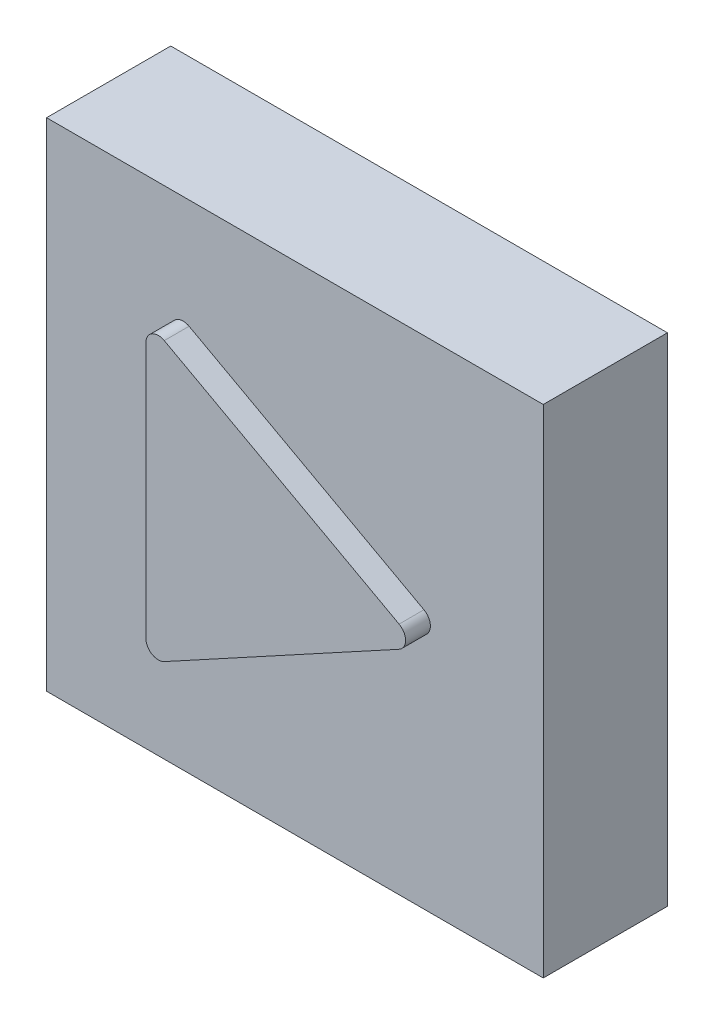
ISO-10303-21;
HEADER;
FILE_DESCRIPTION(('STEP AP214'),'2;1');
FILE_NAME('part.step','',(''),(''),'','','');
FILE_SCHEMA(('AUTOMOTIVE_DESIGN { 1 0 10303 214 1 1 1 1 }'));
ENDSEC;
DATA;
#1=APPLICATION_CONTEXT('core data for automotive mechanical design processes');
#2=APPLICATION_PROTOCOL_DEFINITION('international standard','automotive_design',2000,#1);
#3=PRODUCT_CONTEXT('',#1,'mechanical');
#4=PRODUCT('Part','Part','',(#3));
#5=PRODUCT_RELATED_PRODUCT_CATEGORY('part','',(#4));
#6=PRODUCT_DEFINITION_FORMATION('','',#4);
#7=PRODUCT_DEFINITION_CONTEXT('part definition',#1,'design');
#8=PRODUCT_DEFINITION('design','',#6,#7);
#9=PRODUCT_DEFINITION_SHAPE('','',#8);
#10=(LENGTH_UNIT() NAMED_UNIT(*) SI_UNIT(.MILLI.,.METRE.));
#11=(NAMED_UNIT(*) PLANE_ANGLE_UNIT() SI_UNIT($,.RADIAN.));
#12=(NAMED_UNIT(*) SI_UNIT($,.STERADIAN.) SOLID_ANGLE_UNIT());
#13=UNCERTAINTY_MEASURE_WITH_UNIT(LENGTH_MEASURE(1.E-05),#10,'distance_accuracy_value','');
#14=(GEOMETRIC_REPRESENTATION_CONTEXT(3) GLOBAL_UNCERTAINTY_ASSIGNED_CONTEXT((#13)) GLOBAL_UNIT_ASSIGNED_CONTEXT((#10,
#11,#12)) REPRESENTATION_CONTEXT('',''));
#15=CARTESIAN_POINT('',(0.,0.,0.));
#16=DIRECTION('',(0.,0.,1.));
#17=DIRECTION('',(1.,0.,0.));
#18=AXIS2_PLACEMENT_3D('',#15,#16,#17);
#19=CARTESIAN_POINT('',(0.,0.,5.));
#20=DIRECTION('',(0.,0.,-1.));
#21=DIRECTION('',(-1.,0.,0.));
#22=AXIS2_PLACEMENT_3D('',#19,#20,#21);
#23=PLANE('',#22);
#24=DIRECTION('',(0.,1.,0.));
#25=VECTOR('',#24,1.);
#26=CARTESIAN_POINT('',(10.,-10.,5.));
#27=LINE('',#26,#25);
#28=CARTESIAN_POINT('',(10.,-10.,5.));
#29=VERTEX_POINT('',#28);
#30=CARTESIAN_POINT('',(10.,10.,5.));
#31=VERTEX_POINT('',#30);
#32=EDGE_CURVE('E143',#29,#31,#27,.T.);
#33=ORIENTED_EDGE('',*,*,#32,.T.);
#34=DIRECTION('',(-1.,0.,0.));
#35=VECTOR('',#34,1.);
#36=CARTESIAN_POINT('',(-10.,10.,5.));
#37=LINE('',#36,#35);
#38=CARTESIAN_POINT('',(-10.,10.,5.));
#39=VERTEX_POINT('',#38);
#40=EDGE_CURVE('E146',#31,#39,#37,.T.);
#41=ORIENTED_EDGE('',*,*,#40,.T.);
#42=DIRECTION('',(0.,-1.,0.));
#43=VECTOR('',#42,1.);
#44=CARTESIAN_POINT('',(-10.,-10.,5.));
#45=LINE('',#44,#43);
#46=CARTESIAN_POINT('',(-10.,-10.,5.));
#47=VERTEX_POINT('',#46);
#48=EDGE_CURVE('E149',#39,#47,#45,.T.);
#49=ORIENTED_EDGE('',*,*,#48,.T.);
#50=DIRECTION('',(1.,0.,0.));
#51=VECTOR('',#50,1.);
#52=CARTESIAN_POINT('',(-10.,-10.,5.));
#53=LINE('',#52,#51);
#54=EDGE_CURVE('E151',#47,#29,#53,.T.);
#55=ORIENTED_EDGE('',*,*,#54,.T.);
#56=EDGE_LOOP('',(#33,#41,#49,#55));
#57=FACE_BOUND('',#56,.T.);
#58=CARTESIAN_POINT('',(-4.5,-5.15772890517538,5.));
#59=DIRECTION('',(0.,0.,1.));
#60=DIRECTION('',(1.,0.,0.));
#61=AXIS2_PLACEMENT_3D('',#58,#59,#60);
#62=CIRCLE('',#61,0.5);
#63=CARTESIAN_POINT('',(-5.,-5.15772890517537,5.));
#64=VERTEX_POINT('',#63);
#65=CARTESIAN_POINT('',(-4.26057393465971,-5.59667669163257,5.));
#66=VERTEX_POINT('',#65);
#67=EDGE_CURVE('E130',#64,#66,#62,.T.);
#68=ORIENTED_EDGE('',*,*,#67,.F.);
#69=DIRECTION('',(0.,-1.,0.));
#70=VECTOR('',#69,1.);
#71=CARTESIAN_POINT('',(-5.,5.15772890517537,5.));
#72=LINE('',#71,#70);
#73=CARTESIAN_POINT('',(-5.,5.15772890517537,5.));
#74=VERTEX_POINT('',#73);
#75=EDGE_CURVE('E127',#74,#64,#72,.T.);
#76=ORIENTED_EDGE('',*,*,#75,.F.);
#77=CARTESIAN_POINT('',(-4.5,5.15772890517538,5.));
#78=DIRECTION('',(0.,0.,1.));
#79=DIRECTION('',(-1.,0.,0.));
#80=AXIS2_PLACEMENT_3D('',#77,#78,#79);
#81=CIRCLE('',#80,0.5);
#82=CARTESIAN_POINT('',(-4.26057393465971,5.59667669163257,5.));
#83=VERTEX_POINT('',#82);
#84=EDGE_CURVE('E305',#83,#74,#81,.T.);
#85=ORIENTED_EDGE('',*,*,#84,.F.);
#86=DIRECTION('',(-0.877895572914384,0.478852130680573,0.));
#87=VECTOR('',#86,1.);
#88=CARTESIAN_POINT('',(5.19526239149514,0.438947786457196,5.));
#89=LINE('',#88,#87);
#90=CARTESIAN_POINT('',(5.19526239149514,0.438947786457197,5.));
#91=VERTEX_POINT('',#90);
#92=EDGE_CURVE('E320',#91,#83,#89,.T.);
#93=ORIENTED_EDGE('',*,*,#92,.F.);
#94=CARTESIAN_POINT('',(4.95583632615486,0.,5.));
#95=DIRECTION('',(0.,0.,1.));
#96=DIRECTION('',(1.,0.,0.));
#97=AXIS2_PLACEMENT_3D('',#94,#95,#96);
#98=CIRCLE('',#97,0.5);
#99=CARTESIAN_POINT('',(5.19526239149514,-0.438947786457196,5.));
#100=VERTEX_POINT('',#99);
#101=EDGE_CURVE('E53',#100,#91,#98,.T.);
#102=ORIENTED_EDGE('',*,*,#101,.F.);
#103=DIRECTION('',(0.877895572914384,0.478852130680573,0.));
#104=VECTOR('',#103,1.);
#105=CARTESIAN_POINT('',(-4.26057393465971,-5.59667669163257,5.));
#106=LINE('',#105,#104);
#107=EDGE_CURVE('E48',#66,#100,#106,.T.);
#108=ORIENTED_EDGE('',*,*,#107,.F.);
#109=EDGE_LOOP('',(#68,#76,#85,#93,#102,#108));
#110=FACE_BOUND('',#109,.T.);
#111=ADVANCED_FACE('F33',(#57,#110),#23,.F.);
#112=CARTESIAN_POINT('',(10.,-10.,5.));
#113=DIRECTION('',(-1.,0.,0.));
#114=DIRECTION('',(0.,0.,1.));
#115=AXIS2_PLACEMENT_3D('',#112,#113,#114);
#116=PLANE('',#115);
#117=DIRECTION('',(0.,1.,0.));
#118=VECTOR('',#117,1.);
#119=CARTESIAN_POINT('',(10.,-10.,0.));
#120=LINE('',#119,#118);
#121=CARTESIAN_POINT('',(10.,-10.,0.));
#122=VERTEX_POINT('',#121);
#123=CARTESIAN_POINT('',(10.,10.,0.));
#124=VERTEX_POINT('',#123);
#125=EDGE_CURVE('E142',#122,#124,#120,.T.);
#126=ORIENTED_EDGE('',*,*,#125,.T.);
#127=DIRECTION('',(0.,0.,-1.));
#128=VECTOR('',#127,1.);
#129=CARTESIAN_POINT('',(10.,10.,5.));
#130=LINE('',#129,#128);
#131=EDGE_CURVE('E11',#31,#124,#130,.T.);
#132=ORIENTED_EDGE('',*,*,#131,.F.);
#133=ORIENTED_EDGE('',*,*,#32,.F.);
#134=DIRECTION('',(0.,0.,-1.));
#135=VECTOR('',#134,1.);
#136=CARTESIAN_POINT('',(10.,-10.,5.));
#137=LINE('',#136,#135);
#138=EDGE_CURVE('E153',#29,#122,#137,.T.);
#139=ORIENTED_EDGE('',*,*,#138,.T.);
#140=EDGE_LOOP('',(#126,#132,#133,#139));
#141=FACE_BOUND('',#140,.T.);
#142=ADVANCED_FACE('F35',(#141),#116,.F.);
#143=CARTESIAN_POINT('',(-10.,10.,5.));
#144=DIRECTION('',(0.,-1.,0.));
#145=DIRECTION('',(0.,0.,-1.));
#146=AXIS2_PLACEMENT_3D('',#143,#144,#145);
#147=PLANE('',#146);
#148=DIRECTION('',(-1.,0.,0.));
#149=VECTOR('',#148,1.);
#150=CARTESIAN_POINT('',(-10.,10.,0.));
#151=LINE('',#150,#149);
#152=CARTESIAN_POINT('',(-10.,10.,0.));
#153=VERTEX_POINT('',#152);
#154=EDGE_CURVE('E156',#124,#153,#151,.T.);
#155=ORIENTED_EDGE('',*,*,#154,.T.);
#156=DIRECTION('',(0.,0.,-1.));
#157=VECTOR('',#156,1.);
#158=CARTESIAN_POINT('',(-10.,10.,5.));
#159=LINE('',#158,#157);
#160=EDGE_CURVE('E41',#39,#153,#159,.T.);
#161=ORIENTED_EDGE('',*,*,#160,.F.);
#162=ORIENTED_EDGE('',*,*,#40,.F.);
#163=ORIENTED_EDGE('',*,*,#131,.T.);
#164=EDGE_LOOP('',(#155,#161,#162,#163));
#165=FACE_BOUND('',#164,.T.);
#166=ADVANCED_FACE('F185',(#165),#147,.F.);
#167=CARTESIAN_POINT('',(-10.,-10.,5.));
#168=DIRECTION('',(1.,0.,0.));
#169=DIRECTION('',(0.,0.,-1.));
#170=AXIS2_PLACEMENT_3D('',#167,#168,#169);
#171=PLANE('',#170);
#172=DIRECTION('',(0.,-1.,0.));
#173=VECTOR('',#172,1.);
#174=CARTESIAN_POINT('',(-10.,-10.,0.));
#175=LINE('',#174,#173);
#176=CARTESIAN_POINT('',(-10.,-10.,0.));
#177=VERTEX_POINT('',#176);
#178=EDGE_CURVE('E158',#153,#177,#175,.T.);
#179=ORIENTED_EDGE('',*,*,#178,.T.);
#180=DIRECTION('',(0.,0.,-1.));
#181=VECTOR('',#180,1.);
#182=CARTESIAN_POINT('',(-10.,-10.,5.));
#183=LINE('',#182,#181);
#184=EDGE_CURVE('E163',#47,#177,#183,.T.);
#185=ORIENTED_EDGE('',*,*,#184,.F.);
#186=ORIENTED_EDGE('',*,*,#48,.F.);
#187=ORIENTED_EDGE('',*,*,#160,.T.);
#188=EDGE_LOOP('',(#179,#185,#186,#187));
#189=FACE_BOUND('',#188,.T.);
#190=ADVANCED_FACE('F170',(#189),#171,.F.);
#191=CARTESIAN_POINT('',(-10.,-10.,5.));
#192=DIRECTION('',(0.,1.,0.));
#193=DIRECTION('',(0.,0.,1.));
#194=AXIS2_PLACEMENT_3D('',#191,#192,#193);
#195=PLANE('',#194);
#196=DIRECTION('',(1.,0.,0.));
#197=VECTOR('',#196,1.);
#198=CARTESIAN_POINT('',(-10.,-10.,0.));
#199=LINE('',#198,#197);
#200=EDGE_CURVE('E147',#177,#122,#199,.T.);
#201=ORIENTED_EDGE('',*,*,#200,.T.);
#202=ORIENTED_EDGE('',*,*,#138,.F.);
#203=ORIENTED_EDGE('',*,*,#54,.F.);
#204=ORIENTED_EDGE('',*,*,#184,.T.);
#205=EDGE_LOOP('',(#201,#202,#203,#204));
#206=FACE_BOUND('',#205,.T.);
#207=ADVANCED_FACE('F179',(#206),#195,.F.);
#208=CARTESIAN_POINT('',(0.,0.,0.));
#209=DIRECTION('',(0.,0.,-1.));
#210=DIRECTION('',(-1.,0.,0.));
#211=AXIS2_PLACEMENT_3D('',#208,#209,#210);
#212=PLANE('',#211);
#213=CARTESIAN_POINT('',(0.,0.,0.));
#214=DIRECTION('',(0.,0.,1.));
#215=DIRECTION('',(1.,0.,0.));
#216=AXIS2_PLACEMENT_3D('',#213,#214,#215);
#217=CIRCLE('',#216,0.6);
#218=CARTESIAN_POINT('',(0.6,0.,0.));
#219=VERTEX_POINT('',#218);
#220=EDGE_CURVE('E134',#219,#219,#217,.T.);
#221=ORIENTED_EDGE('',*,*,#220,.T.);
#222=EDGE_LOOP('',(#221));
#223=FACE_BOUND('',#222,.T.);
#224=ORIENTED_EDGE('',*,*,#125,.F.);
#225=ORIENTED_EDGE('',*,*,#200,.F.);
#226=ORIENTED_EDGE('',*,*,#178,.F.);
#227=ORIENTED_EDGE('',*,*,#154,.F.);
#228=EDGE_LOOP('',(#224,#225,#226,#227));
#229=FACE_BOUND('',#228,.T.);
#230=ADVANCED_FACE('F176',(#223,#229),#212,.T.);
#231=CARTESIAN_POINT('',(0.,0.,0.));
#232=DIRECTION('',(0.,0.,1.));
#233=DIRECTION('',(1.,0.,0.));
#234=AXIS2_PLACEMENT_3D('',#231,#232,#233);
#235=CYLINDRICAL_SURFACE('',#234,0.6);
#236=ORIENTED_EDGE('',*,*,#220,.F.);
#237=EDGE_LOOP('',(#236));
#238=FACE_BOUND('',#237,.T.);
#239=CARTESIAN_POINT('',(0.,0.,5.));
#240=DIRECTION('',(0.,0.,1.));
#241=DIRECTION('',(1.,0.,0.));
#242=AXIS2_PLACEMENT_3D('',#239,#240,#241);
#243=CIRCLE('',#242,0.6);
#244=CARTESIAN_POINT('',(0.6,0.,5.));
#245=VERTEX_POINT('',#244);
#246=EDGE_CURVE('E131',#245,#245,#243,.F.);
#247=ORIENTED_EDGE('',*,*,#246,.F.);
#248=EDGE_LOOP('',(#247));
#249=FACE_BOUND('',#248,.T.);
#250=ADVANCED_FACE('F200',(#238,#249),#235,.F.);
#251=CARTESIAN_POINT('',(-4.5,-5.15772890517538,5.));
#252=DIRECTION('',(0.,0.,1.));
#253=DIRECTION('',(1.,0.,0.));
#254=AXIS2_PLACEMENT_3D('',#251,#252,#253);
#255=PLANE('',#254);
#256=ORIENTED_EDGE('',*,*,#246,.T.);
#257=EDGE_LOOP('',(#256));
#258=FACE_BOUND('',#257,.T.);
#259=ADVANCED_FACE('F227',(#258),#255,.F.);
#260=CARTESIAN_POINT('',(-4.5,-5.15772890517538,6.));
#261=DIRECTION('',(0.,0.,-1.));
#262=DIRECTION('',(-1.,0.,0.));
#263=AXIS2_PLACEMENT_3D('',#260,#261,#262);
#264=CYLINDRICAL_SURFACE('',#263,0.5);
#265=ORIENTED_EDGE('',*,*,#67,.T.);
#266=DIRECTION('',(0.,0.,-1.));
#267=VECTOR('',#266,1.);
#268=CARTESIAN_POINT('',(-4.26057393465971,-5.59667669163257,6.));
#269=LINE('',#268,#267);
#270=CARTESIAN_POINT('',(-4.26057393465971,-5.59667669163257,6.));
#271=VERTEX_POINT('',#270);
#272=EDGE_CURVE('E111',#271,#66,#269,.T.);
#273=ORIENTED_EDGE('',*,*,#272,.F.);
#274=CARTESIAN_POINT('',(-4.5,-5.15772890517538,6.));
#275=DIRECTION('',(0.,0.,1.));
#276=DIRECTION('',(1.,0.,0.));
#277=AXIS2_PLACEMENT_3D('',#274,#275,#276);
#278=CIRCLE('',#277,0.5);
#279=CARTESIAN_POINT('',(-5.,-5.15772890517537,6.));
#280=VERTEX_POINT('',#279);
#281=EDGE_CURVE('E118',#280,#271,#278,.T.);
#282=ORIENTED_EDGE('',*,*,#281,.F.);
#283=DIRECTION('',(0.,0.,-1.));
#284=VECTOR('',#283,1.);
#285=CARTESIAN_POINT('',(-5.,-5.15772890517537,6.));
#286=LINE('',#285,#284);
#287=EDGE_CURVE('E301',#280,#64,#286,.T.);
#288=ORIENTED_EDGE('',*,*,#287,.T.);
#289=EDGE_LOOP('',(#265,#273,#282,#288));
#290=FACE_BOUND('',#289,.T.);
#291=ADVANCED_FACE('F129',(#290),#264,.T.);
#292=CARTESIAN_POINT('',(-4.26057393465971,-5.59667669163257,6.));
#293=DIRECTION('',(-0.478852130680573,0.877895572914384,0.));
#294=DIRECTION('',(-0.877895572914384,-0.478852130680573,0.));
#295=AXIS2_PLACEMENT_3D('',#292,#293,#294);
#296=PLANE('',#295);
#297=ORIENTED_EDGE('',*,*,#107,.T.);
#298=DIRECTION('',(0.,0.,-1.));
#299=VECTOR('',#298,1.);
#300=CARTESIAN_POINT('',(5.19526239149514,-0.438947786457196,6.));
#301=LINE('',#300,#299);
#302=CARTESIAN_POINT('',(5.19526239149514,-0.438947786457196,6.));
#303=VERTEX_POINT('',#302);
#304=EDGE_CURVE('E114',#303,#100,#301,.T.);
#305=ORIENTED_EDGE('',*,*,#304,.F.);
#306=DIRECTION('',(0.877895572914384,0.478852130680573,0.));
#307=VECTOR('',#306,1.);
#308=CARTESIAN_POINT('',(-4.26057393465971,-5.59667669163257,6.));
#309=LINE('',#308,#307);
#310=EDGE_CURVE('E107',#271,#303,#309,.T.);
#311=ORIENTED_EDGE('',*,*,#310,.F.);
#312=ORIENTED_EDGE('',*,*,#272,.T.);
#313=EDGE_LOOP('',(#297,#305,#311,#312));
#314=FACE_BOUND('',#313,.T.);
#315=ADVANCED_FACE('F109',(#314),#296,.F.);
#316=CARTESIAN_POINT('',(4.95583632615486,0.,6.));
#317=DIRECTION('',(0.,0.,-1.));
#318=DIRECTION('',(-1.,0.,0.));
#319=AXIS2_PLACEMENT_3D('',#316,#317,#318);
#320=CYLINDRICAL_SURFACE('',#319,0.5);
#321=ORIENTED_EDGE('',*,*,#101,.T.);
#322=DIRECTION('',(0.,0.,-1.));
#323=VECTOR('',#322,1.);
#324=CARTESIAN_POINT('',(5.19526239149514,0.438947786457196,6.));
#325=LINE('',#324,#323);
#326=CARTESIAN_POINT('',(5.19526239149514,0.438947786457196,6.));
#327=VERTEX_POINT('',#326);
#328=EDGE_CURVE('E136',#327,#91,#325,.T.);
#329=ORIENTED_EDGE('',*,*,#328,.F.);
#330=CARTESIAN_POINT('',(4.95583632615486,0.,6.));
#331=DIRECTION('',(0.,0.,1.));
#332=DIRECTION('',(1.,0.,0.));
#333=AXIS2_PLACEMENT_3D('',#330,#331,#332);
#334=CIRCLE('',#333,0.5);
#335=EDGE_CURVE('E117',#303,#327,#334,.T.);
#336=ORIENTED_EDGE('',*,*,#335,.F.);
#337=ORIENTED_EDGE('',*,*,#304,.T.);
#338=EDGE_LOOP('',(#321,#329,#336,#337));
#339=FACE_BOUND('',#338,.T.);
#340=ADVANCED_FACE('F243',(#339),#320,.T.);
#341=CARTESIAN_POINT('',(5.19526239149514,0.438947786457196,6.));
#342=DIRECTION('',(-0.478852130680573,-0.877895572914384,0.));
#343=DIRECTION('',(0.877895572914384,-0.478852130680573,0.));
#344=AXIS2_PLACEMENT_3D('',#341,#342,#343);
#345=PLANE('',#344);
#346=ORIENTED_EDGE('',*,*,#92,.T.);
#347=DIRECTION('',(0.,0.,-1.));
#348=VECTOR('',#347,1.);
#349=CARTESIAN_POINT('',(-4.26057393465971,5.59667669163257,6.));
#350=LINE('',#349,#348);
#351=CARTESIAN_POINT('',(-4.26057393465971,5.59667669163257,6.));
#352=VERTEX_POINT('',#351);
#353=EDGE_CURVE('E308',#352,#83,#350,.T.);
#354=ORIENTED_EDGE('',*,*,#353,.F.);
#355=DIRECTION('',(-0.877895572914384,0.478852130680573,0.));
#356=VECTOR('',#355,1.);
#357=CARTESIAN_POINT('',(5.19526239149514,0.438947786457196,6.));
#358=LINE('',#357,#356);
#359=EDGE_CURVE('E321',#327,#352,#358,.T.);
#360=ORIENTED_EDGE('',*,*,#359,.F.);
#361=ORIENTED_EDGE('',*,*,#328,.T.);
#362=EDGE_LOOP('',(#346,#354,#360,#361));
#363=FACE_BOUND('',#362,.T.);
#364=ADVANCED_FACE('F250',(#363),#345,.F.);
#365=CARTESIAN_POINT('',(-4.5,5.15772890517538,6.));
#366=DIRECTION('',(0.,0.,-1.));
#367=DIRECTION('',(-1.,0.,0.));
#368=AXIS2_PLACEMENT_3D('',#365,#366,#367);
#369=CYLINDRICAL_SURFACE('',#368,0.5);
#370=ORIENTED_EDGE('',*,*,#84,.T.);
#371=DIRECTION('',(0.,0.,-1.));
#372=VECTOR('',#371,1.);
#373=CARTESIAN_POINT('',(-5.,5.15772890517537,6.));
#374=LINE('',#373,#372);
#375=CARTESIAN_POINT('',(-5.,5.15772890517537,6.));
#376=VERTEX_POINT('',#375);
#377=EDGE_CURVE('E303',#376,#74,#374,.T.);
#378=ORIENTED_EDGE('',*,*,#377,.F.);
#379=CARTESIAN_POINT('',(-4.5,5.15772890517538,6.));
#380=DIRECTION('',(0.,0.,1.));
#381=DIRECTION('',(-1.,0.,0.));
#382=AXIS2_PLACEMENT_3D('',#379,#380,#381);
#383=CIRCLE('',#382,0.5);
#384=EDGE_CURVE('E310',#352,#376,#383,.T.);
#385=ORIENTED_EDGE('',*,*,#384,.F.);
#386=ORIENTED_EDGE('',*,*,#353,.T.);
#387=EDGE_LOOP('',(#370,#378,#385,#386));
#388=FACE_BOUND('',#387,.T.);
#389=ADVANCED_FACE('F258',(#388),#369,.T.);
#390=CARTESIAN_POINT('',(-5.,5.15772890517537,6.));
#391=DIRECTION('',(1.,0.,0.));
#392=DIRECTION('',(0.,0.,-1.));
#393=AXIS2_PLACEMENT_3D('',#390,#391,#392);
#394=PLANE('',#393);
#395=ORIENTED_EDGE('',*,*,#75,.T.);
#396=ORIENTED_EDGE('',*,*,#287,.F.);
#397=DIRECTION('',(0.,-1.,0.));
#398=VECTOR('',#397,1.);
#399=CARTESIAN_POINT('',(-5.,5.15772890517537,6.));
#400=LINE('',#399,#398);
#401=EDGE_CURVE('E123',#376,#280,#400,.T.);
#402=ORIENTED_EDGE('',*,*,#401,.F.);
#403=ORIENTED_EDGE('',*,*,#377,.T.);
#404=EDGE_LOOP('',(#395,#396,#402,#403));
#405=FACE_BOUND('',#404,.T.);
#406=ADVANCED_FACE('F266',(#405),#394,.F.);
#407=CARTESIAN_POINT('',(-4.5,-5.15772890517538,6.));
#408=DIRECTION('',(0.,0.,1.));
#409=DIRECTION('',(1.,0.,0.));
#410=AXIS2_PLACEMENT_3D('',#407,#408,#409);
#411=PLANE('',#410);
#412=ORIENTED_EDGE('',*,*,#281,.T.);
#413=ORIENTED_EDGE('',*,*,#310,.T.);
#414=ORIENTED_EDGE('',*,*,#335,.T.);
#415=ORIENTED_EDGE('',*,*,#359,.T.);
#416=ORIENTED_EDGE('',*,*,#384,.T.);
#417=ORIENTED_EDGE('',*,*,#401,.T.);
#418=EDGE_LOOP('',(#412,#413,#414,#415,#416,#417));
#419=FACE_BOUND('',#418,.T.);
#420=ADVANCED_FACE('F121',(#419),#411,.T.);
#421=CLOSED_SHELL('',(#111,#142,#166,#190,#207,#230,#250,#259,#291,#315,#340,#364,#389,#406,#420));
#422=MANIFOLD_SOLID_BREP('B2',#421);
#423=ADVANCED_BREP_SHAPE_REPRESENTATION('',(#18,#422),#14);
#424=SHAPE_DEFINITION_REPRESENTATION(#9,#423);
ENDSEC;
END-ISO-10303-21;
